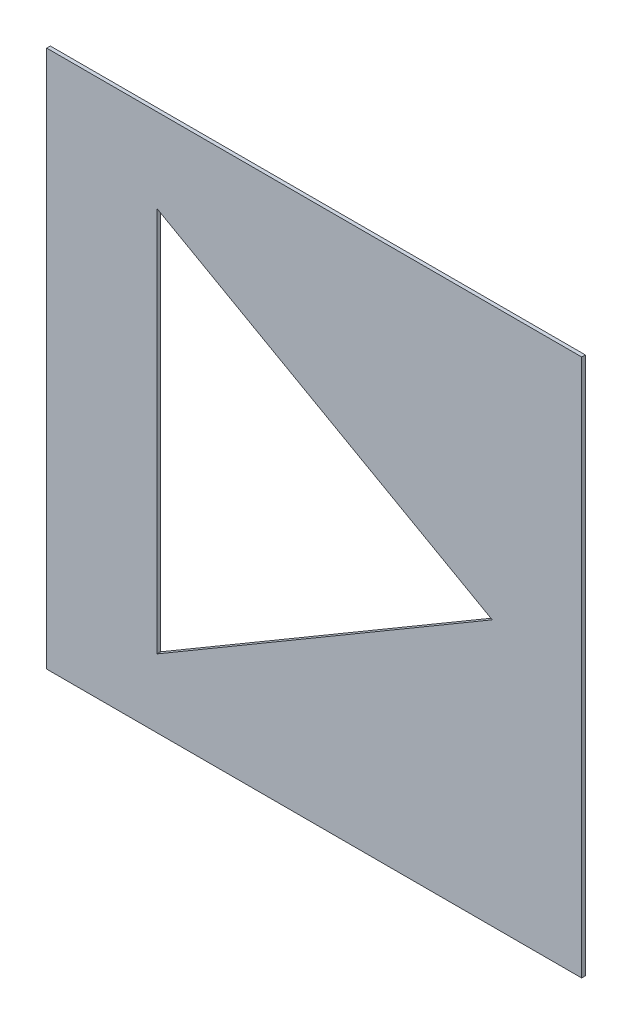
ISO-10303-21;
HEADER;
FILE_DESCRIPTION(('STEP AP214'),'2;1');
FILE_NAME('part.step','',(''),(''),'','','');
FILE_SCHEMA(('AUTOMOTIVE_DESIGN { 1 0 10303 214 1 1 1 1 }'));
ENDSEC;
DATA;
#1=APPLICATION_CONTEXT('core data for automotive mechanical design processes');
#2=APPLICATION_PROTOCOL_DEFINITION('international standard','automotive_design',2000,#1);
#3=PRODUCT_CONTEXT('',#1,'mechanical');
#4=PRODUCT('Part','Part','',(#3));
#5=PRODUCT_RELATED_PRODUCT_CATEGORY('part','',(#4));
#6=PRODUCT_DEFINITION_FORMATION('','',#4);
#7=PRODUCT_DEFINITION_CONTEXT('part definition',#1,'design');
#8=PRODUCT_DEFINITION('design','',#6,#7);
#9=PRODUCT_DEFINITION_SHAPE('','',#8);
#10=(LENGTH_UNIT() NAMED_UNIT(*) SI_UNIT(.MILLI.,.METRE.));
#11=(NAMED_UNIT(*) PLANE_ANGLE_UNIT() SI_UNIT($,.RADIAN.));
#12=(NAMED_UNIT(*) SI_UNIT($,.STERADIAN.) SOLID_ANGLE_UNIT());
#13=UNCERTAINTY_MEASURE_WITH_UNIT(LENGTH_MEASURE(1.E-05),#10,'distance_accuracy_value','');
#14=(GEOMETRIC_REPRESENTATION_CONTEXT(3) GLOBAL_UNCERTAINTY_ASSIGNED_CONTEXT((#13)) GLOBAL_UNIT_ASSIGNED_CONTEXT((#10,
#11,#12)) REPRESENTATION_CONTEXT('',''));
#15=CARTESIAN_POINT('',(0.,0.,0.));
#16=DIRECTION('',(0.,0.,1.));
#17=DIRECTION('',(1.,0.,0.));
#18=AXIS2_PLACEMENT_3D('',#15,#16,#17);
#19=CARTESIAN_POINT('',(2.7165023680184,-0.705790844319904,0.));
#20=DIRECTION('',(-0.506875367812856,0.86201935100355,0.));
#21=DIRECTION('',(-0.86201935100355,-0.506875367812856,0.));
#22=AXIS2_PLACEMENT_3D('',#19,#20,#21);
#23=PLANE('',#22);
#24=DIRECTION('',(-0.86201935100355,-0.506875367812856,0.));
#25=VECTOR('',#24,1.);
#26=CARTESIAN_POINT('',(2.7165023680184,-0.705790844319904,0.));
#27=LINE('',#26,#25);
#28=CARTESIAN_POINT('',(2.7165023680184,-0.705790844319904,0.));
#29=VERTEX_POINT('',#28);
#30=CARTESIAN_POINT('',(2.4389105815866,-0.869017387535751,0.));
#31=VERTEX_POINT('',#30);
#32=EDGE_CURVE('E11',#29,#31,#27,.T.);
#33=ORIENTED_EDGE('',*,*,#32,.T.);
#34=DIRECTION('',(0.,0.,1.));
#35=VECTOR('',#34,1.);
#36=CARTESIAN_POINT('',(2.4389105815866,-0.869017387535751,0.));
#37=LINE('',#36,#35);
#38=CARTESIAN_POINT('',(2.4389105815866,-0.869017387535751,0.003));
#39=VERTEX_POINT('',#38);
#40=EDGE_CURVE('E24',#31,#39,#37,.T.);
#41=ORIENTED_EDGE('',*,*,#40,.T.);
#42=DIRECTION('',(-0.86201935100355,-0.506875367812856,0.));
#43=VECTOR('',#42,1.);
#44=CARTESIAN_POINT('',(2.7165023680184,-0.705790844319904,0.003));
#45=LINE('',#44,#43);
#46=CARTESIAN_POINT('',(2.7165023680184,-0.705790844319904,0.003));
#47=VERTEX_POINT('',#46);
#48=EDGE_CURVE('E133',#47,#39,#45,.T.);
#49=ORIENTED_EDGE('',*,*,#48,.F.);
#50=DIRECTION('',(0.,0.,1.));
#51=VECTOR('',#50,1.);
#52=CARTESIAN_POINT('',(2.7165023680184,-0.705790844319904,0.));
#53=LINE('',#52,#51);
#54=EDGE_CURVE('E130',#29,#47,#53,.T.);
#55=ORIENTED_EDGE('',*,*,#54,.F.);
#56=EDGE_LOOP('',(#33,#41,#49,#55));
#57=FACE_BOUND('',#56,.T.);
#58=ADVANCED_FACE('F17',(#57),#23,.T.);
#59=CARTESIAN_POINT('',(2.4389105815866,-0.549671692078979,0.));
#60=DIRECTION('',(-0.49019868005848,-0.87161072392951,0.));
#61=DIRECTION('',(0.87161072392951,-0.49019868005848,0.));
#62=AXIS2_PLACEMENT_3D('',#59,#60,#61);
#63=PLANE('',#62);
#64=DIRECTION('',(0.87161072392951,-0.49019868005848,0.));
#65=VECTOR('',#64,1.);
#66=CARTESIAN_POINT('',(2.4389105815866,-0.549671692078979,0.));
#67=LINE('',#66,#65);
#68=CARTESIAN_POINT('',(2.4389105815866,-0.549671692078979,0.));
#69=VERTEX_POINT('',#68);
#70=EDGE_CURVE('E127',#69,#29,#67,.T.);
#71=ORIENTED_EDGE('',*,*,#70,.T.);
#72=ORIENTED_EDGE('',*,*,#54,.T.);
#73=DIRECTION('',(0.87161072392951,-0.49019868005848,0.));
#74=VECTOR('',#73,1.);
#75=CARTESIAN_POINT('',(2.4389105815866,-0.549671692078979,0.003));
#76=LINE('',#75,#74);
#77=CARTESIAN_POINT('',(2.4389105815866,-0.549671692078979,0.003));
#78=VERTEX_POINT('',#77);
#79=EDGE_CURVE('E124',#78,#47,#76,.T.);
#80=ORIENTED_EDGE('',*,*,#79,.F.);
#81=DIRECTION('',(0.,0.,1.));
#82=VECTOR('',#81,1.);
#83=CARTESIAN_POINT('',(2.4389105815866,-0.549671692078979,0.));
#84=LINE('',#83,#82);
#85=EDGE_CURVE('E121',#69,#78,#84,.T.);
#86=ORIENTED_EDGE('',*,*,#85,.F.);
#87=EDGE_LOOP('',(#71,#72,#80,#86));
#88=FACE_BOUND('',#87,.T.);
#89=ADVANCED_FACE('F140',(#88),#63,.T.);
#90=CARTESIAN_POINT('',(2.4389105815866,-0.869017387535751,0.));
#91=DIRECTION('',(1.,0.,0.));
#92=DIRECTION('',(0.,1.,0.));
#93=AXIS2_PLACEMENT_3D('',#90,#91,#92);
#94=PLANE('',#93);
#95=DIRECTION('',(0.,1.,0.));
#96=VECTOR('',#95,1.);
#97=CARTESIAN_POINT('',(2.4389105815866,-0.869017387535751,0.));
#98=LINE('',#97,#96);
#99=EDGE_CURVE('E118',#31,#69,#98,.T.);
#100=ORIENTED_EDGE('',*,*,#99,.T.);
#101=ORIENTED_EDGE('',*,*,#85,.T.);
#102=DIRECTION('',(0.,1.,0.));
#103=VECTOR('',#102,1.);
#104=CARTESIAN_POINT('',(2.4389105815866,-0.869017387535751,0.003));
#105=LINE('',#104,#103);
#106=EDGE_CURVE('E115',#39,#78,#105,.T.);
#107=ORIENTED_EDGE('',*,*,#106,.F.);
#108=ORIENTED_EDGE('',*,*,#40,.F.);
#109=EDGE_LOOP('',(#100,#101,#107,#108));
#110=FACE_BOUND('',#109,.T.);
#111=ADVANCED_FACE('F137',(#110),#94,.T.);
#112=CARTESIAN_POINT('',(2.7905156665764,-0.48038433961971,0.));
#113=DIRECTION('',(0.,1.,0.));
#114=DIRECTION('',(-1.,0.,0.));
#115=AXIS2_PLACEMENT_3D('',#112,#113,#114);
#116=PLANE('',#115);
#117=DIRECTION('',(-1.,0.,0.));
#118=VECTOR('',#117,1.);
#119=CARTESIAN_POINT('',(2.7905156665764,-0.48038433961971,0.));
#120=LINE('',#119,#118);
#121=CARTESIAN_POINT('',(2.7905156665764,-0.48038433961971,0.));
#122=VERTEX_POINT('',#121);
#123=CARTESIAN_POINT('',(2.347794681828,-0.48038433961971,0.));
#124=VERTEX_POINT('',#123);
#125=EDGE_CURVE('E113',#122,#124,#120,.T.);
#126=ORIENTED_EDGE('',*,*,#125,.T.);
#127=DIRECTION('',(0.,0.,1.));
#128=VECTOR('',#127,1.);
#129=CARTESIAN_POINT('',(2.347794681828,-0.48038433961971,0.));
#130=LINE('',#129,#128);
#131=CARTESIAN_POINT('',(2.347794681828,-0.48038433961971,0.003));
#132=VERTEX_POINT('',#131);
#133=EDGE_CURVE('E111',#124,#132,#130,.T.);
#134=ORIENTED_EDGE('',*,*,#133,.T.);
#135=DIRECTION('',(-1.,0.,0.));
#136=VECTOR('',#135,1.);
#137=CARTESIAN_POINT('',(2.7905156665764,-0.48038433961971,0.003));
#138=LINE('',#137,#136);
#139=CARTESIAN_POINT('',(2.7905156665764,-0.48038433961971,0.003));
#140=VERTEX_POINT('',#139);
#141=EDGE_CURVE('E96',#140,#132,#138,.T.);
#142=ORIENTED_EDGE('',*,*,#141,.F.);
#143=DIRECTION('',(0.,0.,1.));
#144=VECTOR('',#143,1.);
#145=CARTESIAN_POINT('',(2.7905156665764,-0.48038433961971,0.));
#146=LINE('',#145,#144);
#147=EDGE_CURVE('E107',#122,#140,#146,.T.);
#148=ORIENTED_EDGE('',*,*,#147,.F.);
#149=EDGE_LOOP('',(#126,#134,#142,#148));
#150=FACE_BOUND('',#149,.T.);
#151=ADVANCED_FACE('F157',(#150),#116,.T.);
#152=CARTESIAN_POINT('',(2.7905156665764,-0.925487186045347,0.));
#153=DIRECTION('',(1.,0.,0.));
#154=DIRECTION('',(0.,1.,0.));
#155=AXIS2_PLACEMENT_3D('',#152,#153,#154);
#156=PLANE('',#155);
#157=DIRECTION('',(0.,1.,0.));
#158=VECTOR('',#157,1.);
#159=CARTESIAN_POINT('',(2.7905156665764,-0.925487186045347,0.));
#160=LINE('',#159,#158);
#161=CARTESIAN_POINT('',(2.7905156665764,-0.925487186045347,0.));
#162=VERTEX_POINT('',#161);
#163=EDGE_CURVE('E104',#162,#122,#160,.T.);
#164=ORIENTED_EDGE('',*,*,#163,.T.);
#165=ORIENTED_EDGE('',*,*,#147,.T.);
#166=DIRECTION('',(0.,1.,0.));
#167=VECTOR('',#166,1.);
#168=CARTESIAN_POINT('',(2.7905156665764,-0.925487186045347,0.003));
#169=LINE('',#168,#167);
#170=CARTESIAN_POINT('',(2.7905156665764,-0.925487186045347,0.003));
#171=VERTEX_POINT('',#170);
#172=EDGE_CURVE('E102',#171,#140,#169,.T.);
#173=ORIENTED_EDGE('',*,*,#172,.F.);
#174=DIRECTION('',(0.,0.,1.));
#175=VECTOR('',#174,1.);
#176=CARTESIAN_POINT('',(2.7905156665764,-0.925487186045347,0.));
#177=LINE('',#176,#175);
#178=EDGE_CURVE('E79',#162,#171,#177,.T.);
#179=ORIENTED_EDGE('',*,*,#178,.F.);
#180=EDGE_LOOP('',(#164,#165,#173,#179));
#181=FACE_BOUND('',#180,.T.);
#182=ADVANCED_FACE('F162',(#181),#156,.T.);
#183=CARTESIAN_POINT('',(2.347794681828,-0.925487186045347,0.));
#184=DIRECTION('',(0.,-1.,0.));
#185=DIRECTION('',(1.,0.,0.));
#186=AXIS2_PLACEMENT_3D('',#183,#184,#185);
#187=PLANE('',#186);
#188=DIRECTION('',(1.,0.,0.));
#189=VECTOR('',#188,1.);
#190=CARTESIAN_POINT('',(2.347794681828,-0.925487186045347,0.));
#191=LINE('',#190,#189);
#192=CARTESIAN_POINT('',(2.347794681828,-0.925487186045347,0.));
#193=VERTEX_POINT('',#192);
#194=EDGE_CURVE('E83',#193,#162,#191,.T.);
#195=ORIENTED_EDGE('',*,*,#194,.T.);
#196=ORIENTED_EDGE('',*,*,#178,.T.);
#197=DIRECTION('',(1.,0.,0.));
#198=VECTOR('',#197,1.);
#199=CARTESIAN_POINT('',(2.347794681828,-0.925487186045347,0.003));
#200=LINE('',#199,#198);
#201=CARTESIAN_POINT('',(2.347794681828,-0.925487186045347,0.003));
#202=VERTEX_POINT('',#201);
#203=EDGE_CURVE('E72',#202,#171,#200,.T.);
#204=ORIENTED_EDGE('',*,*,#203,.F.);
#205=DIRECTION('',(0.,0.,1.));
#206=VECTOR('',#205,1.);
#207=CARTESIAN_POINT('',(2.347794681828,-0.925487186045347,0.));
#208=LINE('',#207,#206);
#209=EDGE_CURVE('E76',#193,#202,#208,.T.);
#210=ORIENTED_EDGE('',*,*,#209,.F.);
#211=EDGE_LOOP('',(#195,#196,#204,#210));
#212=FACE_BOUND('',#211,.T.);
#213=ADVANCED_FACE('F75',(#212),#187,.T.);
#214=CARTESIAN_POINT('',(2.347794681828,-0.48038433961971,0.));
#215=DIRECTION('',(-1.,0.,0.));
#216=DIRECTION('',(0.,-1.,0.));
#217=AXIS2_PLACEMENT_3D('',#214,#215,#216);
#218=PLANE('',#217);
#219=DIRECTION('',(0.,-1.,0.));
#220=VECTOR('',#219,1.);
#221=CARTESIAN_POINT('',(2.347794681828,-0.48038433961971,0.));
#222=LINE('',#221,#220);
#223=EDGE_CURVE('E91',#124,#193,#222,.T.);
#224=ORIENTED_EDGE('',*,*,#223,.T.);
#225=ORIENTED_EDGE('',*,*,#209,.T.);
#226=DIRECTION('',(0.,-1.,0.));
#227=VECTOR('',#226,1.);
#228=CARTESIAN_POINT('',(2.347794681828,-0.48038433961971,0.003));
#229=LINE('',#228,#227);
#230=EDGE_CURVE('E89',#132,#202,#229,.T.);
#231=ORIENTED_EDGE('',*,*,#230,.F.);
#232=ORIENTED_EDGE('',*,*,#133,.F.);
#233=EDGE_LOOP('',(#224,#225,#231,#232));
#234=FACE_BOUND('',#233,.T.);
#235=ADVANCED_FACE('F87',(#234),#218,.T.);
#236=CARTESIAN_POINT('',(2.5691551742022,-0.702935762832529,0.003));
#237=DIRECTION('',(0.,0.,1.));
#238=DIRECTION('',(1.,0.,0.));
#239=AXIS2_PLACEMENT_3D('',#236,#237,#238);
#240=PLANE('',#239);
#241=ORIENTED_EDGE('',*,*,#230,.T.);
#242=ORIENTED_EDGE('',*,*,#203,.T.);
#243=ORIENTED_EDGE('',*,*,#172,.T.);
#244=ORIENTED_EDGE('',*,*,#141,.T.);
#245=EDGE_LOOP('',(#241,#242,#243,#244));
#246=FACE_BOUND('',#245,.T.);
#247=ORIENTED_EDGE('',*,*,#106,.T.);
#248=ORIENTED_EDGE('',*,*,#79,.T.);
#249=ORIENTED_EDGE('',*,*,#48,.T.);
#250=EDGE_LOOP('',(#247,#248,#249));
#251=FACE_BOUND('',#250,.T.);
#252=ADVANCED_FACE('F94',(#246,#251),#240,.T.);
#253=CARTESIAN_POINT('',(2.5691551742022,-0.702935762832529,0.));
#254=DIRECTION('',(0.,0.,1.));
#255=DIRECTION('',(1.,0.,0.));
#256=AXIS2_PLACEMENT_3D('',#253,#254,#255);
#257=PLANE('',#256);
#258=ORIENTED_EDGE('',*,*,#223,.F.);
#259=ORIENTED_EDGE('',*,*,#125,.F.);
#260=ORIENTED_EDGE('',*,*,#163,.F.);
#261=ORIENTED_EDGE('',*,*,#194,.F.);
#262=EDGE_LOOP('',(#258,#259,#260,#261));
#263=FACE_BOUND('',#262,.T.);
#264=ORIENTED_EDGE('',*,*,#99,.F.);
#265=ORIENTED_EDGE('',*,*,#32,.F.);
#266=ORIENTED_EDGE('',*,*,#70,.F.);
#267=EDGE_LOOP('',(#264,#265,#266));
#268=FACE_BOUND('',#267,.T.);
#269=ADVANCED_FACE('F141',(#263,#268),#257,.F.);
#270=CLOSED_SHELL('',(#58,#89,#111,#151,#182,#213,#235,#252,#269));
#271=MANIFOLD_SOLID_BREP('B1',#270);
#272=ADVANCED_BREP_SHAPE_REPRESENTATION('',(#18,#271),#14);
#273=SHAPE_DEFINITION_REPRESENTATION(#9,#272);
ENDSEC;
END-ISO-10303-21;
